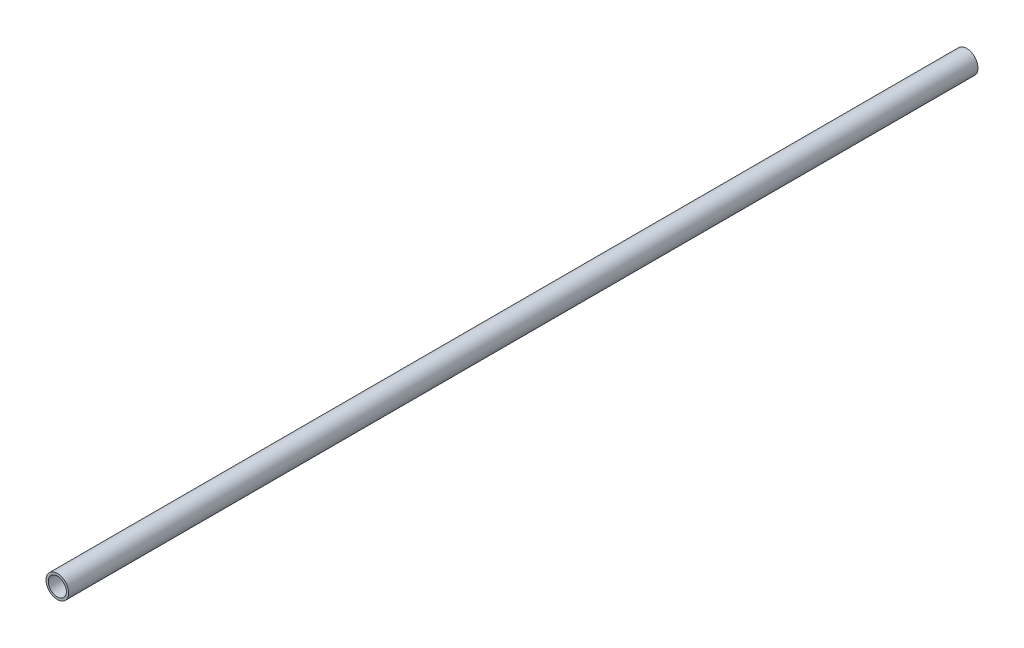
ISO-10303-21;
HEADER;
FILE_DESCRIPTION(('STEP AP214'),'2;1');
FILE_NAME('part.step','',(''),(''),'','','');
FILE_SCHEMA(('AUTOMOTIVE_DESIGN { 1 0 10303 214 1 1 1 1 }'));
ENDSEC;
DATA;
#1=APPLICATION_CONTEXT('core data for automotive mechanical design processes');
#2=APPLICATION_PROTOCOL_DEFINITION('international standard','automotive_design',2000,#1);
#3=PRODUCT_CONTEXT('',#1,'mechanical');
#4=PRODUCT('Part','Part','',(#3));
#5=PRODUCT_RELATED_PRODUCT_CATEGORY('part','',(#4));
#6=PRODUCT_DEFINITION_FORMATION('','',#4);
#7=PRODUCT_DEFINITION_CONTEXT('part definition',#1,'design');
#8=PRODUCT_DEFINITION('design','',#6,#7);
#9=PRODUCT_DEFINITION_SHAPE('','',#8);
#10=(LENGTH_UNIT() NAMED_UNIT(*) SI_UNIT(.MILLI.,.METRE.));
#11=(NAMED_UNIT(*) PLANE_ANGLE_UNIT() SI_UNIT($,.RADIAN.));
#12=(NAMED_UNIT(*) SI_UNIT($,.STERADIAN.) SOLID_ANGLE_UNIT());
#13=UNCERTAINTY_MEASURE_WITH_UNIT(LENGTH_MEASURE(1.E-05),#10,'distance_accuracy_value','');
#14=(GEOMETRIC_REPRESENTATION_CONTEXT(3) GLOBAL_UNCERTAINTY_ASSIGNED_CONTEXT((#13)) GLOBAL_UNIT_ASSIGNED_CONTEXT((#10,
#11,#12)) REPRESENTATION_CONTEXT('',''));
#15=CARTESIAN_POINT('',(0.,0.,0.));
#16=DIRECTION('',(0.,0.,1.));
#17=DIRECTION('',(1.,0.,0.));
#18=AXIS2_PLACEMENT_3D('',#15,#16,#17);
#19=CARTESIAN_POINT('',(0.,0.,801.8));
#20=DIRECTION('',(0.,0.,1.));
#21=DIRECTION('',(1.,0.,0.));
#22=AXIS2_PLACEMENT_3D('',#19,#20,#21);
#23=PLANE('',#22);
#24=CARTESIAN_POINT('',(0.,0.,801.8));
#25=DIRECTION('',(0.,0.,1.));
#26=DIRECTION('',(1.,0.,0.));
#27=AXIS2_PLACEMENT_3D('',#24,#25,#26);
#28=CIRCLE('',#27,10.);
#29=CARTESIAN_POINT('',(10.,0.,801.8));
#30=VERTEX_POINT('',#29);
#31=EDGE_CURVE('E10',#30,#30,#28,.T.);
#32=ORIENTED_EDGE('',*,*,#31,.T.);
#33=EDGE_LOOP('',(#32));
#34=FACE_BOUND('',#33,.T.);
#35=CARTESIAN_POINT('',(0.,0.,801.8));
#36=DIRECTION('',(0.,0.,1.));
#37=DIRECTION('',(1.,0.,0.));
#38=AXIS2_PLACEMENT_3D('',#35,#36,#37);
#39=CIRCLE('',#38,8.);
#40=CARTESIAN_POINT('',(8.,0.,801.8));
#41=VERTEX_POINT('',#40);
#42=EDGE_CURVE('E41',#41,#41,#39,.T.);
#43=ORIENTED_EDGE('',*,*,#42,.F.);
#44=EDGE_LOOP('',(#43));
#45=FACE_BOUND('',#44,.T.);
#46=ADVANCED_FACE('F30',(#34,#45),#23,.T.);
#47=CARTESIAN_POINT('',(0.,0.,0.));
#48=DIRECTION('',(0.,0.,1.));
#49=DIRECTION('',(1.,0.,0.));
#50=AXIS2_PLACEMENT_3D('',#47,#48,#49);
#51=PLANE('',#50);
#52=CARTESIAN_POINT('',(0.,0.,0.));
#53=DIRECTION('',(0.,0.,1.));
#54=DIRECTION('',(1.,0.,0.));
#55=AXIS2_PLACEMENT_3D('',#52,#53,#54);
#56=CIRCLE('',#55,10.);
#57=CARTESIAN_POINT('',(10.,0.,0.));
#58=VERTEX_POINT('',#57);
#59=EDGE_CURVE('E34',#58,#58,#56,.T.);
#60=ORIENTED_EDGE('',*,*,#59,.F.);
#61=EDGE_LOOP('',(#60));
#62=FACE_BOUND('',#61,.T.);
#63=CARTESIAN_POINT('',(0.,0.,0.));
#64=DIRECTION('',(0.,0.,1.));
#65=DIRECTION('',(1.,0.,0.));
#66=AXIS2_PLACEMENT_3D('',#63,#64,#65);
#67=CIRCLE('',#66,8.);
#68=CARTESIAN_POINT('',(8.,0.,0.));
#69=VERTEX_POINT('',#68);
#70=EDGE_CURVE('E43',#69,#69,#67,.T.);
#71=ORIENTED_EDGE('',*,*,#70,.T.);
#72=EDGE_LOOP('',(#71));
#73=FACE_BOUND('',#72,.T.);
#74=ADVANCED_FACE('F53',(#62,#73),#51,.F.);
#75=CARTESIAN_POINT('',(0.,0.,801.8));
#76=DIRECTION('',(0.,0.,-1.));
#77=DIRECTION('',(-1.,0.,0.));
#78=AXIS2_PLACEMENT_3D('',#75,#76,#77);
#79=CYLINDRICAL_SURFACE('',#78,10.);
#80=ORIENTED_EDGE('',*,*,#31,.F.);
#81=EDGE_LOOP('',(#80));
#82=FACE_BOUND('',#81,.T.);
#83=ORIENTED_EDGE('',*,*,#59,.T.);
#84=EDGE_LOOP('',(#83));
#85=FACE_BOUND('',#84,.T.);
#86=ADVANCED_FACE('F32',(#82,#85),#79,.T.);
#87=CARTESIAN_POINT('',(0.,0.,801.8));
#88=DIRECTION('',(0.,0.,-1.));
#89=DIRECTION('',(-1.,0.,0.));
#90=AXIS2_PLACEMENT_3D('',#87,#88,#89);
#91=CYLINDRICAL_SURFACE('',#90,8.);
#92=ORIENTED_EDGE('',*,*,#42,.T.);
#93=EDGE_LOOP('',(#92));
#94=FACE_BOUND('',#93,.T.);
#95=ORIENTED_EDGE('',*,*,#70,.F.);
#96=EDGE_LOOP('',(#95));
#97=FACE_BOUND('',#96,.T.);
#98=ADVANCED_FACE('F49',(#94,#97),#91,.F.);
#99=CLOSED_SHELL('',(#46,#74,#86,#98));
#100=MANIFOLD_SOLID_BREP('B2',#99);
#101=ADVANCED_BREP_SHAPE_REPRESENTATION('',(#18,#100),#14);
#102=SHAPE_DEFINITION_REPRESENTATION(#9,#101);
ENDSEC;
END-ISO-10303-21;
